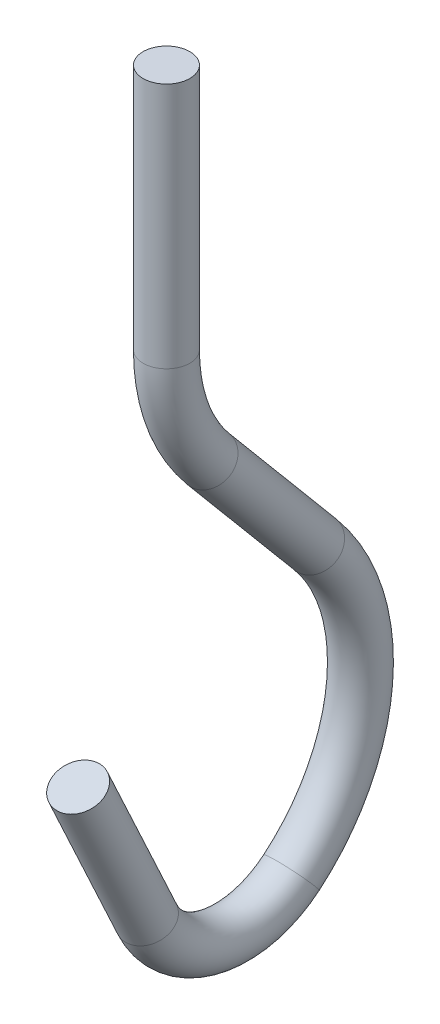
ISO-10303-21;
HEADER;
FILE_DESCRIPTION(('STEP AP214'),'2;1');
FILE_NAME('part.step','',(''),(''),'','','');
FILE_SCHEMA(('AUTOMOTIVE_DESIGN { 1 0 10303 214 1 1 1 1 }'));
ENDSEC;
DATA;
#1=APPLICATION_CONTEXT('core data for automotive mechanical design processes');
#2=APPLICATION_PROTOCOL_DEFINITION('international standard','automotive_design',2000,#1);
#3=PRODUCT_CONTEXT('',#1,'mechanical');
#4=PRODUCT('Part','Part','',(#3));
#5=PRODUCT_RELATED_PRODUCT_CATEGORY('part','',(#4));
#6=PRODUCT_DEFINITION_FORMATION('','',#4);
#7=PRODUCT_DEFINITION_CONTEXT('part definition',#1,'design');
#8=PRODUCT_DEFINITION('design','',#6,#7);
#9=PRODUCT_DEFINITION_SHAPE('','',#8);
#10=(LENGTH_UNIT() NAMED_UNIT(*) SI_UNIT(.MILLI.,.METRE.));
#11=(NAMED_UNIT(*) PLANE_ANGLE_UNIT() SI_UNIT($,.RADIAN.));
#12=(NAMED_UNIT(*) SI_UNIT($,.STERADIAN.) SOLID_ANGLE_UNIT());
#13=UNCERTAINTY_MEASURE_WITH_UNIT(LENGTH_MEASURE(1.E-05),#10,'distance_accuracy_value','');
#14=(GEOMETRIC_REPRESENTATION_CONTEXT(3) GLOBAL_UNCERTAINTY_ASSIGNED_CONTEXT((#13)) GLOBAL_UNIT_ASSIGNED_CONTEXT((#10,
#11,#12)) REPRESENTATION_CONTEXT('',''));
#15=CARTESIAN_POINT('',(0.,0.,0.));
#16=DIRECTION('',(0.,0.,1.));
#17=DIRECTION('',(1.,0.,0.));
#18=AXIS2_PLACEMENT_3D('',#15,#16,#17);
#19=CARTESIAN_POINT('',(0.,0.,0.));
#20=DIRECTION('',(0.,1.,0.));
#21=DIRECTION('',(0.,0.,1.));
#22=AXIS2_PLACEMENT_3D('',#19,#20,#21);
#23=PLANE('',#22);
#24=CARTESIAN_POINT('',(0.,0.,0.));
#25=DIRECTION('',(0.,1.,0.));
#26=DIRECTION('',(0.,0.,1.));
#27=AXIS2_PLACEMENT_3D('',#24,#25,#26);
#28=CIRCLE('',#27,0.635);
#29=CARTESIAN_POINT('',(0.,0.,0.635));
#30=VERTEX_POINT('',#29);
#31=EDGE_CURVE('E68',#30,#30,#28,.T.);
#32=ORIENTED_EDGE('',*,*,#31,.T.);
#33=EDGE_LOOP('',(#32));
#34=FACE_BOUND('',#33,.T.);
#35=ADVANCED_FACE('F37',(#34),#23,.T.);
#36=CARTESIAN_POINT('',(0.,-15.8162637631021,2.40399793800358));
#37=DIRECTION('',(0.,-0.907258355206624,-0.420573747287881));
#38=DIRECTION('',(0.,0.420573747287881,-0.907258355206624));
#39=AXIS2_PLACEMENT_3D('',#36,#37,#38);
#40=PLANE('',#39);
#41=CARTESIAN_POINT('',(0.,-15.8162637631021,2.40399793800358));
#42=DIRECTION('',(0.,-0.907258355206624,-0.420573747287881));
#43=DIRECTION('',(0.,0.420573747287881,-0.907258355206624));
#44=AXIS2_PLACEMENT_3D('',#41,#42,#43);
#45=CIRCLE('',#44,0.635);
#46=CARTESIAN_POINT('',(0.,-15.5491994335743,1.82788888244737));
#47=VERTEX_POINT('',#46);
#48=EDGE_CURVE('E10',#47,#47,#45,.T.);
#49=ORIENTED_EDGE('',*,*,#48,.F.);
#50=EDGE_LOOP('',(#49));
#51=FACE_BOUND('',#50,.T.);
#52=ADVANCED_FACE('F77',(#51),#40,.F.);
#53=CARTESIAN_POINT('',(0.,0.,0.));
#54=DIRECTION('',(0.,-1.,0.));
#55=DIRECTION('',(0.,0.,-1.));
#56=AXIS2_PLACEMENT_3D('',#53,#54,#55);
#57=CYLINDRICAL_SURFACE('',#56,0.635);
#58=CARTESIAN_POINT('',(0.,-6.71108984997,0.));
#59=DIRECTION('',(0.,1.,0.));
#60=DIRECTION('',(0.,0.,1.));
#61=AXIS2_PLACEMENT_3D('',#58,#59,#60);
#62=CIRCLE('',#61,0.635);
#63=CARTESIAN_POINT('',(0.,-6.71108984997,0.634999999999999));
#64=VERTEX_POINT('',#63);
#65=EDGE_CURVE('E64',#64,#64,#62,.T.);
#66=ORIENTED_EDGE('',*,*,#65,.T.);
#67=EDGE_LOOP('',(#66));
#68=FACE_BOUND('',#67,.T.);
#69=ORIENTED_EDGE('',*,*,#31,.F.);
#70=EDGE_LOOP('',(#69));
#71=FACE_BOUND('',#70,.T.);
#72=ADVANCED_FACE('F74',(#68,#71),#57,.T.);
#73=CARTESIAN_POINT('',(0.,-6.71108984997,-4.90699169303368));
#74=DIRECTION('',(1.,0.,0.));
#75=DIRECTION('',(0.,0.,-1.));
#76=AXIS2_PLACEMENT_3D('',#73,#74,#75);
#77=TOROIDAL_SURFACE('',#76,4.90699169303368,0.635);
#78=CARTESIAN_POINT('',(0.,-9.86524331108683,-1.14801797415425));
#79=DIRECTION('',(0.,0.766044443118976,0.642787609686541));
#80=DIRECTION('',(0.,-0.642787609686541,0.766044443118976));
#81=AXIS2_PLACEMENT_3D('',#78,#79,#80);
#82=CIRCLE('',#81,0.635);
#83=CARTESIAN_POINT('',(0.,-10.2734134432378,-0.661579752773701));
#84=VERTEX_POINT('',#83);
#85=EDGE_CURVE('E60',#84,#84,#82,.T.);
#86=CARTESIAN_POINT('',(0.,-6.71108984997,-4.90699169303368));
#87=DIRECTION('',(1.,0.,0.));
#88=DIRECTION('',(0.,0.,-1.));
#89=AXIS2_PLACEMENT_3D('',#86,#87,#88);
#90=CIRCLE('',#89,5.54199169303368);
#91=EDGE_CURVE('',#64,#84,#90,.T.);
#92=ORIENTED_EDGE('',*,*,#65,.F.);
#93=ORIENTED_EDGE('',*,*,#85,.T.);
#94=ORIENTED_EDGE('',*,*,#91,.T.);
#95=ORIENTED_EDGE('',*,*,#91,.F.);
#96=EDGE_LOOP('',(#92,#94,#93,#95));
#97=FACE_BOUND('',#96,.T.);
#98=ADVANCED_FACE('F76',(#97),#77,.T.);
#99=CARTESIAN_POINT('',(0.,-9.86524331108683,-1.14801797415425));
#100=DIRECTION('',(0.,-0.766044443118977,-0.642787609686541));
#101=DIRECTION('',(0.,0.642787609686541,-0.766044443118977));
#102=AXIS2_PLACEMENT_3D('',#99,#100,#101);
#103=CYLINDRICAL_SURFACE('',#102,0.635);
#104=CARTESIAN_POINT('',(0.,-13.3218382827849,-4.04844554003537));
#105=DIRECTION('',(0.,0.766044443118977,0.642787609686541));
#106=DIRECTION('',(0.,-0.642787609686541,0.766044443118977));
#107=AXIS2_PLACEMENT_3D('',#104,#105,#106);
#108=CIRCLE('',#107,0.635);
#109=CARTESIAN_POINT('',(0.,-12.913668150634,-4.53488376141592));
#110=VERTEX_POINT('',#109);
#111=EDGE_CURVE('E54',#110,#110,#108,.T.);
#112=ORIENTED_EDGE('',*,*,#111,.T.);
#113=EDGE_LOOP('',(#112));
#114=FACE_BOUND('',#113,.T.);
#115=ORIENTED_EDGE('',*,*,#85,.F.);
#116=EDGE_LOOP('',(#115));
#117=FACE_BOUND('',#116,.T.);
#118=ADVANCED_FACE('F84',(#114,#117),#103,.T.);
#119=CARTESIAN_POINT('',(0.,-16.7033901153449,-0.0184689950384507));
#120=DIRECTION('',(-1.,0.,0.));
#121=DIRECTION('',(0.,0.,1.));
#122=AXIS2_PLACEMENT_3D('',#119,#120,#121);
#123=TOROIDAL_SURFACE('',#122,5.2607607576771,0.635);
#124=CARTESIAN_POINT('',(0.,-20.7333666603419,-3.40002082759847));
#125=DIRECTION('',(0.,0.642787609686541,-0.766044443118976));
#126=DIRECTION('',(0.,0.766044443118976,0.642787609686541));
#127=AXIS2_PLACEMENT_3D('',#124,#125,#126);
#128=CIRCLE('',#127,0.635);
#129=CARTESIAN_POINT('',(0.,-21.2198048817224,-3.80819095974942));
#130=VERTEX_POINT('',#129);
#131=EDGE_CURVE('E49',#130,#130,#128,.T.);
#132=CARTESIAN_POINT('',(0.,-16.7033901153449,-0.0184689950384507));
#133=DIRECTION('',(-1.,0.,0.));
#134=DIRECTION('',(0.,0.,1.));
#135=AXIS2_PLACEMENT_3D('',#132,#133,#134);
#136=CIRCLE('',#135,5.8957607576771);
#137=EDGE_CURVE('',#110,#130,#136,.T.);
#138=ORIENTED_EDGE('',*,*,#111,.F.);
#139=ORIENTED_EDGE('',*,*,#131,.T.);
#140=ORIENTED_EDGE('',*,*,#137,.T.);
#141=ORIENTED_EDGE('',*,*,#137,.F.);
#142=EDGE_LOOP('',(#138,#140,#139,#141));
#143=FACE_BOUND('',#142,.T.);
#144=ADVANCED_FACE('F95',(#143),#123,.T.);
#145=CARTESIAN_POINT('',(0.,-18.790766862631,-1.76998605381424));
#146=DIRECTION('',(-1.,0.,0.));
#147=DIRECTION('',(0.,0.,1.));
#148=AXIS2_PLACEMENT_3D('',#145,#146,#147);
#149=TOROIDAL_SURFACE('',#148,2.53588393618714,0.635);
#150=CARTESIAN_POINT('',(0.,-19.8572930723604,0.530715835125802));
#151=DIRECTION('',(0.,-0.907258355206624,-0.420573747287881));
#152=DIRECTION('',(0.,0.420573747287881,-0.907258355206624));
#153=AXIS2_PLACEMENT_3D('',#150,#151,#152);
#154=CIRCLE('',#153,0.635);
#155=CARTESIAN_POINT('',(0.,-20.1243574018882,1.10682489068201));
#156=VERTEX_POINT('',#155);
#157=EDGE_CURVE('E44',#156,#156,#154,.T.);
#158=CARTESIAN_POINT('',(0.,-18.790766862631,-1.76998605381424));
#159=DIRECTION('',(-1.,0.,0.));
#160=DIRECTION('',(0.,0.,1.));
#161=AXIS2_PLACEMENT_3D('',#158,#159,#160);
#162=CIRCLE('',#161,3.17088393618714);
#163=EDGE_CURVE('',#130,#156,#162,.T.);
#164=ORIENTED_EDGE('',*,*,#131,.F.);
#165=ORIENTED_EDGE('',*,*,#157,.T.);
#166=ORIENTED_EDGE('',*,*,#163,.T.);
#167=ORIENTED_EDGE('',*,*,#163,.F.);
#168=EDGE_LOOP('',(#164,#166,#165,#167));
#169=FACE_BOUND('',#168,.T.);
#170=ADVANCED_FACE('F90',(#169),#149,.T.);
#171=CARTESIAN_POINT('',(0.,-19.8572930723604,0.530715835125803));
#172=DIRECTION('',(0.,0.907258355206624,0.420573747287881));
#173=DIRECTION('',(0.,-0.420573747287881,0.907258355206624));
#174=AXIS2_PLACEMENT_3D('',#171,#172,#173);
#175=CYLINDRICAL_SURFACE('',#174,0.635);
#176=ORIENTED_EDGE('',*,*,#48,.T.);
#177=EDGE_LOOP('',(#176));
#178=FACE_BOUND('',#177,.T.);
#179=ORIENTED_EDGE('',*,*,#157,.F.);
#180=EDGE_LOOP('',(#179));
#181=FACE_BOUND('',#180,.T.);
#182=ADVANCED_FACE('F88',(#178,#181),#175,.T.);
#183=CLOSED_SHELL('',(#35,#52,#72,#98,#118,#144,#170,#182));
#184=MANIFOLD_SOLID_BREP('B2',#183);
#185=ADVANCED_BREP_SHAPE_REPRESENTATION('',(#18,#184),#14);
#186=SHAPE_DEFINITION_REPRESENTATION(#9,#185);
ENDSEC;
END-ISO-10303-21;
